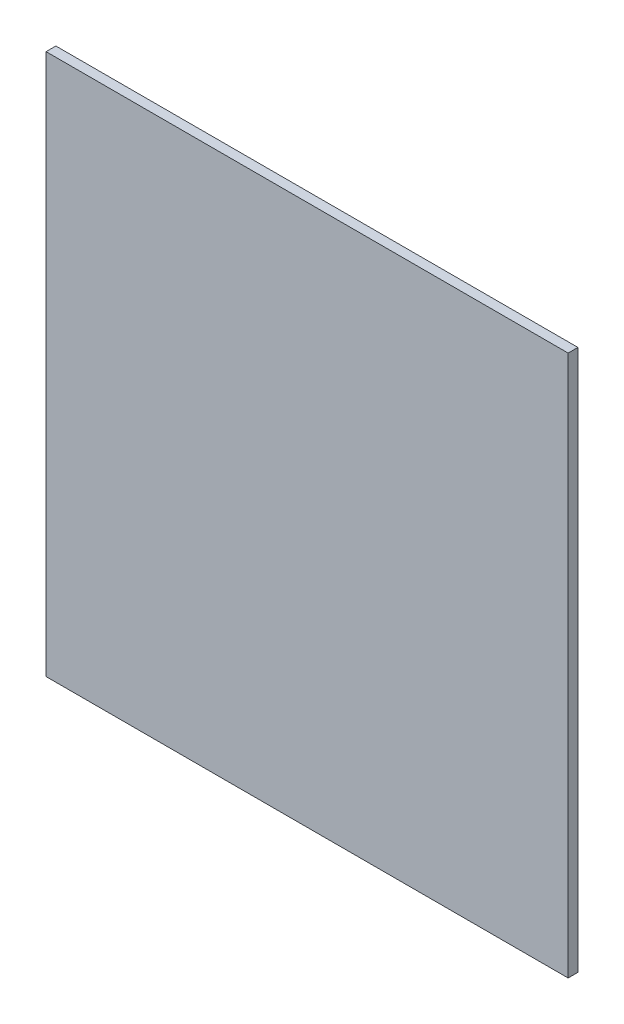
ISO-10303-21;
HEADER;
FILE_DESCRIPTION(('STEP AP214'),'2;1');
FILE_NAME('part.step','',(''),(''),'','','');
FILE_SCHEMA(('AUTOMOTIVE_DESIGN { 1 0 10303 214 1 1 1 1 }'));
ENDSEC;
DATA;
#1=APPLICATION_CONTEXT('core data for automotive mechanical design processes');
#2=APPLICATION_PROTOCOL_DEFINITION('international standard','automotive_design',2000,#1);
#3=PRODUCT_CONTEXT('',#1,'mechanical');
#4=PRODUCT('Part','Part','',(#3));
#5=PRODUCT_RELATED_PRODUCT_CATEGORY('part','',(#4));
#6=PRODUCT_DEFINITION_FORMATION('','',#4);
#7=PRODUCT_DEFINITION_CONTEXT('part definition',#1,'design');
#8=PRODUCT_DEFINITION('design','',#6,#7);
#9=PRODUCT_DEFINITION_SHAPE('','',#8);
#10=(LENGTH_UNIT() NAMED_UNIT(*) SI_UNIT(.MILLI.,.METRE.));
#11=(NAMED_UNIT(*) PLANE_ANGLE_UNIT() SI_UNIT($,.RADIAN.));
#12=(NAMED_UNIT(*) SI_UNIT($,.STERADIAN.) SOLID_ANGLE_UNIT());
#13=UNCERTAINTY_MEASURE_WITH_UNIT(LENGTH_MEASURE(1.E-05),#10,'distance_accuracy_value','');
#14=(GEOMETRIC_REPRESENTATION_CONTEXT(3) GLOBAL_UNCERTAINTY_ASSIGNED_CONTEXT((#13)) GLOBAL_UNIT_ASSIGNED_CONTEXT((#10,
#11,#12)) REPRESENTATION_CONTEXT('',''));
#15=CARTESIAN_POINT('',(0.,0.,0.));
#16=DIRECTION('',(0.,0.,1.));
#17=DIRECTION('',(1.,0.,0.));
#18=AXIS2_PLACEMENT_3D('',#15,#16,#17);
#19=CARTESIAN_POINT('',(40.,41.4692864329527,1.5));
#20=DIRECTION('',(-1.,0.,0.));
#21=DIRECTION('',(0.,-1.,0.));
#22=AXIS2_PLACEMENT_3D('',#19,#20,#21);
#23=PLANE('',#22);
#24=DIRECTION('',(0.,1.,0.));
#25=VECTOR('',#24,1.);
#26=CARTESIAN_POINT('',(40.,41.4692864329527,0.));
#27=LINE('',#26,#25);
#28=CARTESIAN_POINT('',(40.,-41.4692864329527,0.));
#29=VERTEX_POINT('',#28);
#30=CARTESIAN_POINT('',(40.,41.4692864329527,0.));
#31=VERTEX_POINT('',#30);
#32=EDGE_CURVE('E97',#29,#31,#27,.T.);
#33=ORIENTED_EDGE('',*,*,#32,.T.);
#34=DIRECTION('',(0.,0.,-1.));
#35=VECTOR('',#34,1.);
#36=CARTESIAN_POINT('',(40.,41.4692864329527,1.5));
#37=LINE('',#36,#35);
#38=CARTESIAN_POINT('',(40.,41.4692864329527,1.5));
#39=VERTEX_POINT('',#38);
#40=EDGE_CURVE('E11',#39,#31,#37,.T.);
#41=ORIENTED_EDGE('',*,*,#40,.F.);
#42=DIRECTION('',(0.,1.,0.));
#43=VECTOR('',#42,1.);
#44=CARTESIAN_POINT('',(40.,41.4692864329527,1.5));
#45=LINE('',#44,#43);
#46=CARTESIAN_POINT('',(40.,-41.4692864329527,1.5));
#47=VERTEX_POINT('',#46);
#48=EDGE_CURVE('E82',#47,#39,#45,.T.);
#49=ORIENTED_EDGE('',*,*,#48,.F.);
#50=DIRECTION('',(0.,0.,-1.));
#51=VECTOR('',#50,1.);
#52=CARTESIAN_POINT('',(40.,-41.4692864329527,1.5));
#53=LINE('',#52,#51);
#54=EDGE_CURVE('E93',#47,#29,#53,.T.);
#55=ORIENTED_EDGE('',*,*,#54,.T.);
#56=EDGE_LOOP('',(#33,#41,#49,#55));
#57=FACE_BOUND('',#56,.T.);
#58=ADVANCED_FACE('F33',(#57),#23,.F.);
#59=CARTESIAN_POINT('',(-40.,41.4692864329527,1.5));
#60=DIRECTION('',(0.,-1.,0.));
#61=DIRECTION('',(0.,0.,-1.));
#62=AXIS2_PLACEMENT_3D('',#59,#60,#61);
#63=PLANE('',#62);
#64=DIRECTION('',(-1.,0.,0.));
#65=VECTOR('',#64,1.);
#66=CARTESIAN_POINT('',(-40.,41.4692864329527,0.));
#67=LINE('',#66,#65);
#68=CARTESIAN_POINT('',(-40.,41.4692864329527,0.));
#69=VERTEX_POINT('',#68);
#70=EDGE_CURVE('E88',#31,#69,#67,.T.);
#71=ORIENTED_EDGE('',*,*,#70,.T.);
#72=DIRECTION('',(0.,0.,-1.));
#73=VECTOR('',#72,1.);
#74=CARTESIAN_POINT('',(-40.,41.4692864329527,1.5));
#75=LINE('',#74,#73);
#76=CARTESIAN_POINT('',(-40.,41.4692864329527,1.5));
#77=VERTEX_POINT('',#76);
#78=EDGE_CURVE('E41',#77,#69,#75,.T.);
#79=ORIENTED_EDGE('',*,*,#78,.F.);
#80=DIRECTION('',(-1.,0.,0.));
#81=VECTOR('',#80,1.);
#82=CARTESIAN_POINT('',(-40.,41.4692864329527,1.5));
#83=LINE('',#82,#81);
#84=EDGE_CURVE('E76',#39,#77,#83,.T.);
#85=ORIENTED_EDGE('',*,*,#84,.F.);
#86=ORIENTED_EDGE('',*,*,#40,.T.);
#87=EDGE_LOOP('',(#71,#79,#85,#86));
#88=FACE_BOUND('',#87,.T.);
#89=ADVANCED_FACE('F87',(#88),#63,.F.);
#90=CARTESIAN_POINT('',(-40.,-41.4692864329527,1.5));
#91=DIRECTION('',(1.,0.,0.));
#92=DIRECTION('',(0.,0.,-1.));
#93=AXIS2_PLACEMENT_3D('',#90,#91,#92);
#94=PLANE('',#93);
#95=DIRECTION('',(0.,-1.,0.));
#96=VECTOR('',#95,1.);
#97=CARTESIAN_POINT('',(-40.,-41.4692864329527,0.));
#98=LINE('',#97,#96);
#99=CARTESIAN_POINT('',(-40.,-41.4692864329527,0.));
#100=VERTEX_POINT('',#99);
#101=EDGE_CURVE('E101',#69,#100,#98,.T.);
#102=ORIENTED_EDGE('',*,*,#101,.T.);
#103=DIRECTION('',(0.,0.,-1.));
#104=VECTOR('',#103,1.);
#105=CARTESIAN_POINT('',(-40.,-41.4692864329527,1.5));
#106=LINE('',#105,#104);
#107=CARTESIAN_POINT('',(-40.,-41.4692864329527,1.5));
#108=VERTEX_POINT('',#107);
#109=EDGE_CURVE('E90',#108,#100,#106,.T.);
#110=ORIENTED_EDGE('',*,*,#109,.F.);
#111=DIRECTION('',(0.,-1.,0.));
#112=VECTOR('',#111,1.);
#113=CARTESIAN_POINT('',(-40.,41.4692864329527,1.5));
#114=LINE('',#113,#112);
#115=EDGE_CURVE('E79',#77,#108,#114,.T.);
#116=ORIENTED_EDGE('',*,*,#115,.F.);
#117=ORIENTED_EDGE('',*,*,#78,.T.);
#118=EDGE_LOOP('',(#102,#110,#116,#117));
#119=FACE_BOUND('',#118,.T.);
#120=ADVANCED_FACE('F91',(#119),#94,.F.);
#121=CARTESIAN_POINT('',(-30.,-41.4692864329527,1.5));
#122=DIRECTION('',(0.,1.,0.));
#123=DIRECTION('',(0.,0.,1.));
#124=AXIS2_PLACEMENT_3D('',#121,#122,#123);
#125=PLANE('',#124);
#126=DIRECTION('',(1.,0.,0.));
#127=VECTOR('',#126,1.);
#128=CARTESIAN_POINT('',(-30.,-41.4692864329527,0.));
#129=LINE('',#128,#127);
#130=EDGE_CURVE('E65',#100,#29,#129,.T.);
#131=ORIENTED_EDGE('',*,*,#130,.T.);
#132=ORIENTED_EDGE('',*,*,#54,.F.);
#133=DIRECTION('',(1.,0.,0.));
#134=VECTOR('',#133,1.);
#135=CARTESIAN_POINT('',(-30.,-41.4692864329527,1.5));
#136=LINE('',#135,#134);
#137=EDGE_CURVE('E49',#108,#47,#136,.T.);
#138=ORIENTED_EDGE('',*,*,#137,.F.);
#139=ORIENTED_EDGE('',*,*,#109,.T.);
#140=EDGE_LOOP('',(#131,#132,#138,#139));
#141=FACE_BOUND('',#140,.T.);
#142=ADVANCED_FACE('F105',(#141),#125,.F.);
#143=CARTESIAN_POINT('',(0.,0.,1.5));
#144=DIRECTION('',(0.,0.,1.));
#145=DIRECTION('',(1.,0.,0.));
#146=AXIS2_PLACEMENT_3D('',#143,#144,#145);
#147=PLANE('',#146);
#148=ORIENTED_EDGE('',*,*,#48,.T.);
#149=ORIENTED_EDGE('',*,*,#84,.T.);
#150=ORIENTED_EDGE('',*,*,#115,.T.);
#151=ORIENTED_EDGE('',*,*,#137,.T.);
#152=EDGE_LOOP('',(#148,#149,#150,#151));
#153=FACE_BOUND('',#152,.T.);
#154=ADVANCED_FACE('F77',(#153),#147,.T.);
#155=CARTESIAN_POINT('',(0.,0.,0.));
#156=DIRECTION('',(0.,0.,1.));
#157=DIRECTION('',(1.,0.,0.));
#158=AXIS2_PLACEMENT_3D('',#155,#156,#157);
#159=PLANE('',#158);
#160=ORIENTED_EDGE('',*,*,#32,.F.);
#161=ORIENTED_EDGE('',*,*,#130,.F.);
#162=ORIENTED_EDGE('',*,*,#101,.F.);
#163=ORIENTED_EDGE('',*,*,#70,.F.);
#164=EDGE_LOOP('',(#160,#161,#162,#163));
#165=FACE_BOUND('',#164,.T.);
#166=ADVANCED_FACE('F107',(#165),#159,.F.);
#167=CLOSED_SHELL('',(#58,#89,#120,#142,#154,#166));
#168=MANIFOLD_SOLID_BREP('B2',#167);
#169=ADVANCED_BREP_SHAPE_REPRESENTATION('',(#18,#168),#14);
#170=SHAPE_DEFINITION_REPRESENTATION(#9,#169);
ENDSEC;
END-ISO-10303-21;
